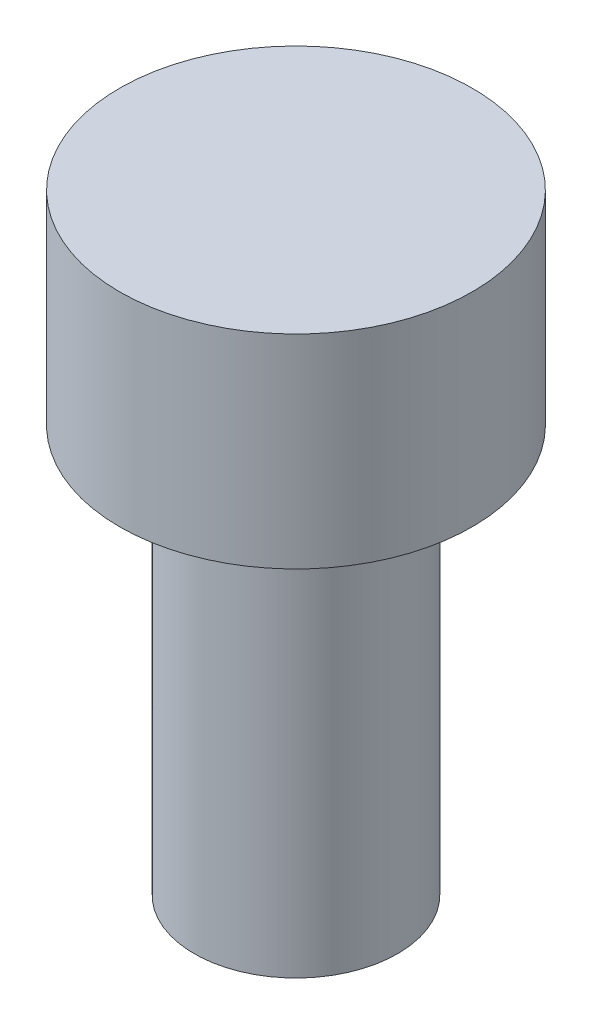
ISO-10303-21;
HEADER;
FILE_DESCRIPTION(('STEP AP214'),'2;1');
FILE_NAME('part.step','',(''),(''),'','','');
FILE_SCHEMA(('AUTOMOTIVE_DESIGN { 1 0 10303 214 1 1 1 1 }'));
ENDSEC;
DATA;
#1=APPLICATION_CONTEXT('core data for automotive mechanical design processes');
#2=APPLICATION_PROTOCOL_DEFINITION('international standard','automotive_design',2000,#1);
#3=PRODUCT_CONTEXT('',#1,'mechanical');
#4=PRODUCT('Part','Part','',(#3));
#5=PRODUCT_RELATED_PRODUCT_CATEGORY('part','',(#4));
#6=PRODUCT_DEFINITION_FORMATION('','',#4);
#7=PRODUCT_DEFINITION_CONTEXT('part definition',#1,'design');
#8=PRODUCT_DEFINITION('design','',#6,#7);
#9=PRODUCT_DEFINITION_SHAPE('','',#8);
#10=(LENGTH_UNIT() NAMED_UNIT(*) SI_UNIT(.MILLI.,.METRE.));
#11=(NAMED_UNIT(*) PLANE_ANGLE_UNIT() SI_UNIT($,.RADIAN.));
#12=(NAMED_UNIT(*) SI_UNIT($,.STERADIAN.) SOLID_ANGLE_UNIT());
#13=UNCERTAINTY_MEASURE_WITH_UNIT(LENGTH_MEASURE(1.E-05),#10,'distance_accuracy_value','');
#14=(GEOMETRIC_REPRESENTATION_CONTEXT(3) GLOBAL_UNCERTAINTY_ASSIGNED_CONTEXT((#13)) GLOBAL_UNIT_ASSIGNED_CONTEXT((#10,
#11,#12)) REPRESENTATION_CONTEXT('',''));
#15=CARTESIAN_POINT('',(0.,0.,0.));
#16=DIRECTION('',(0.,0.,1.));
#17=DIRECTION('',(1.,0.,0.));
#18=AXIS2_PLACEMENT_3D('',#15,#16,#17);
#19=CARTESIAN_POINT('',(0.,3.,0.));
#20=DIRECTION('',(0.,-1.,0.));
#21=DIRECTION('',(0.,0.,-1.));
#22=AXIS2_PLACEMENT_3D('',#19,#20,#21);
#23=CYLINDRICAL_SURFACE('',#22,2.6);
#24=CARTESIAN_POINT('',(0.,3.,0.));
#25=DIRECTION('',(0.,1.,0.));
#26=DIRECTION('',(0.,0.,1.));
#27=AXIS2_PLACEMENT_3D('',#24,#25,#26);
#28=CIRCLE('',#27,2.6);
#29=CARTESIAN_POINT('',(0.,3.,2.6));
#30=VERTEX_POINT('',#29);
#31=EDGE_CURVE('E49',#30,#30,#28,.T.);
#32=ORIENTED_EDGE('',*,*,#31,.F.);
#33=EDGE_LOOP('',(#32));
#34=FACE_BOUND('',#33,.T.);
#35=CARTESIAN_POINT('',(0.,0.,0.));
#36=DIRECTION('',(0.,1.,0.));
#37=DIRECTION('',(0.,0.,1.));
#38=AXIS2_PLACEMENT_3D('',#35,#36,#37);
#39=CIRCLE('',#38,2.6);
#40=CARTESIAN_POINT('',(0.,0.,2.6));
#41=VERTEX_POINT('',#40);
#42=EDGE_CURVE('E44',#41,#41,#39,.T.);
#43=ORIENTED_EDGE('',*,*,#42,.T.);
#44=EDGE_LOOP('',(#43));
#45=FACE_BOUND('',#44,.T.);
#46=ADVANCED_FACE('F41',(#34,#45),#23,.T.);
#47=CARTESIAN_POINT('',(0.,3.,0.));
#48=DIRECTION('',(0.,1.,0.));
#49=DIRECTION('',(0.,0.,1.));
#50=AXIS2_PLACEMENT_3D('',#47,#48,#49);
#51=PLANE('',#50);
#52=ORIENTED_EDGE('',*,*,#31,.T.);
#53=EDGE_LOOP('',(#52));
#54=FACE_BOUND('',#53,.T.);
#55=ADVANCED_FACE('F69',(#54),#51,.T.);
#56=CARTESIAN_POINT('',(0.,0.,0.));
#57=DIRECTION('',(0.,1.,0.));
#58=DIRECTION('',(0.,0.,1.));
#59=AXIS2_PLACEMENT_3D('',#56,#57,#58);
#60=PLANE('',#59);
#61=CARTESIAN_POINT('',(0.,0.,0.));
#62=DIRECTION('',(0.,-1.,0.));
#63=DIRECTION('',(0.,0.,-1.));
#64=AXIS2_PLACEMENT_3D('',#61,#62,#63);
#65=CIRCLE('',#64,1.5);
#66=CARTESIAN_POINT('',(0.,0.,-1.5));
#67=VERTEX_POINT('',#66);
#68=EDGE_CURVE('E10',#67,#67,#65,.T.);
#69=ORIENTED_EDGE('',*,*,#68,.F.);
#70=EDGE_LOOP('',(#69));
#71=FACE_BOUND('',#70,.T.);
#72=ORIENTED_EDGE('',*,*,#42,.F.);
#73=EDGE_LOOP('',(#72));
#74=FACE_BOUND('',#73,.T.);
#75=ADVANCED_FACE('F66',(#71,#74),#60,.F.);
#76=CARTESIAN_POINT('',(0.,-6.,0.));
#77=DIRECTION('',(0.,1.,0.));
#78=DIRECTION('',(0.,0.,1.));
#79=AXIS2_PLACEMENT_3D('',#76,#77,#78);
#80=CYLINDRICAL_SURFACE('',#79,1.5);
#81=CARTESIAN_POINT('',(0.,-6.,0.));
#82=DIRECTION('',(0.,-1.,0.));
#83=DIRECTION('',(0.,0.,-1.));
#84=AXIS2_PLACEMENT_3D('',#81,#82,#83);
#85=CIRCLE('',#84,1.5);
#86=CARTESIAN_POINT('',(0.,-6.,-1.5));
#87=VERTEX_POINT('',#86);
#88=EDGE_CURVE('E56',#87,#87,#85,.T.);
#89=ORIENTED_EDGE('',*,*,#88,.F.);
#90=EDGE_LOOP('',(#89));
#91=FACE_BOUND('',#90,.T.);
#92=ORIENTED_EDGE('',*,*,#68,.T.);
#93=EDGE_LOOP('',(#92));
#94=FACE_BOUND('',#93,.T.);
#95=ADVANCED_FACE('F68',(#91,#94),#80,.T.);
#96=CARTESIAN_POINT('',(0.,-6.,0.));
#97=DIRECTION('',(0.,-1.,0.));
#98=DIRECTION('',(0.,0.,-1.));
#99=AXIS2_PLACEMENT_3D('',#96,#97,#98);
#100=PLANE('',#99);
#101=ORIENTED_EDGE('',*,*,#88,.T.);
#102=EDGE_LOOP('',(#101));
#103=FACE_BOUND('',#102,.T.);
#104=ADVANCED_FACE('F75',(#103),#100,.T.);
#105=CLOSED_SHELL('',(#46,#55,#75,#95,#104));
#106=MANIFOLD_SOLID_BREP('B2',#105);
#107=ADVANCED_BREP_SHAPE_REPRESENTATION('',(#18,#106),#14);
#108=SHAPE_DEFINITION_REPRESENTATION(#9,#107);
ENDSEC;
END-ISO-10303-21;
